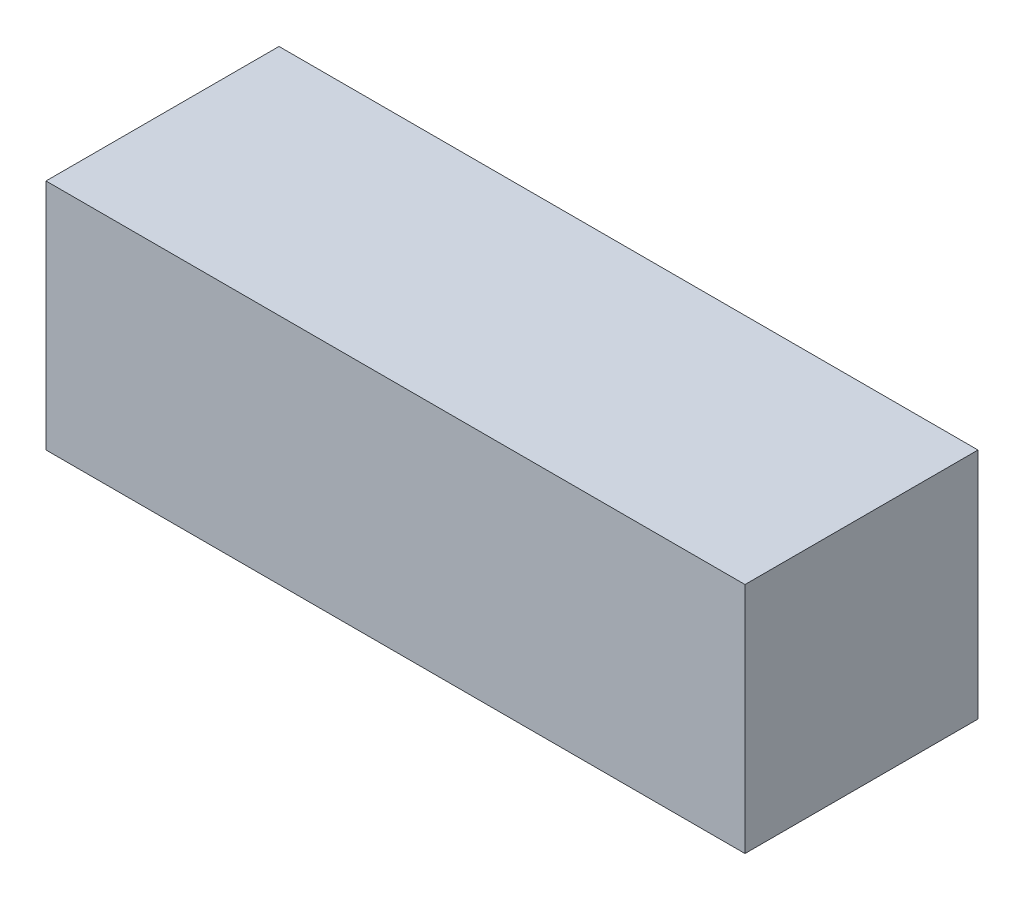
ISO-10303-21;
HEADER;
FILE_DESCRIPTION(('STEP AP214'),'2;1');
FILE_NAME('part.step','',(''),(''),'','','');
FILE_SCHEMA(('AUTOMOTIVE_DESIGN { 1 0 10303 214 1 1 1 1 }'));
ENDSEC;
DATA;
#1=APPLICATION_CONTEXT('core data for automotive mechanical design processes');
#2=APPLICATION_PROTOCOL_DEFINITION('international standard','automotive_design',2000,#1);
#3=PRODUCT_CONTEXT('',#1,'mechanical');
#4=PRODUCT('Part','Part','',(#3));
#5=PRODUCT_RELATED_PRODUCT_CATEGORY('part','',(#4));
#6=PRODUCT_DEFINITION_FORMATION('','',#4);
#7=PRODUCT_DEFINITION_CONTEXT('part definition',#1,'design');
#8=PRODUCT_DEFINITION('design','',#6,#7);
#9=PRODUCT_DEFINITION_SHAPE('','',#8);
#10=(LENGTH_UNIT() NAMED_UNIT(*) SI_UNIT(.MILLI.,.METRE.));
#11=(NAMED_UNIT(*) PLANE_ANGLE_UNIT() SI_UNIT($,.RADIAN.));
#12=(NAMED_UNIT(*) SI_UNIT($,.STERADIAN.) SOLID_ANGLE_UNIT());
#13=UNCERTAINTY_MEASURE_WITH_UNIT(LENGTH_MEASURE(1.E-05),#10,'distance_accuracy_value','');
#14=(GEOMETRIC_REPRESENTATION_CONTEXT(3) GLOBAL_UNCERTAINTY_ASSIGNED_CONTEXT((#13)) GLOBAL_UNIT_ASSIGNED_CONTEXT((#10,
#11,#12)) REPRESENTATION_CONTEXT('',''));
#15=CARTESIAN_POINT('',(0.,0.,0.));
#16=DIRECTION('',(0.,0.,1.));
#17=DIRECTION('',(1.,0.,0.));
#18=AXIS2_PLACEMENT_3D('',#15,#16,#17);
#19=CARTESIAN_POINT('',(3.,2.,-1.));
#20=DIRECTION('',(-1.,0.,0.));
#21=DIRECTION('',(0.,0.,1.));
#22=AXIS2_PLACEMENT_3D('',#19,#20,#21);
#23=PLANE('',#22);
#24=DIRECTION('',(0.,0.,-1.));
#25=VECTOR('',#24,1.);
#26=CARTESIAN_POINT('',(3.,0.,-1.));
#27=LINE('',#26,#25);
#28=CARTESIAN_POINT('',(3.,0.,1.));
#29=VERTEX_POINT('',#28);
#30=CARTESIAN_POINT('',(3.,0.,-1.));
#31=VERTEX_POINT('',#30);
#32=EDGE_CURVE('E99',#29,#31,#27,.T.);
#33=ORIENTED_EDGE('',*,*,#32,.T.);
#34=DIRECTION('',(0.,-1.,0.));
#35=VECTOR('',#34,1.);
#36=CARTESIAN_POINT('',(3.,2.,-1.));
#37=LINE('',#36,#35);
#38=CARTESIAN_POINT('',(3.,2.,-1.));
#39=VERTEX_POINT('',#38);
#40=EDGE_CURVE('E11',#39,#31,#37,.T.);
#41=ORIENTED_EDGE('',*,*,#40,.F.);
#42=DIRECTION('',(0.,0.,-1.));
#43=VECTOR('',#42,1.);
#44=CARTESIAN_POINT('',(3.,2.,-1.));
#45=LINE('',#44,#43);
#46=CARTESIAN_POINT('',(3.,2.,1.));
#47=VERTEX_POINT('',#46);
#48=EDGE_CURVE('E87',#47,#39,#45,.T.);
#49=ORIENTED_EDGE('',*,*,#48,.F.);
#50=DIRECTION('',(0.,-1.,0.));
#51=VECTOR('',#50,1.);
#52=CARTESIAN_POINT('',(3.,2.,1.));
#53=LINE('',#52,#51);
#54=EDGE_CURVE('E95',#47,#29,#53,.T.);
#55=ORIENTED_EDGE('',*,*,#54,.T.);
#56=EDGE_LOOP('',(#33,#41,#49,#55));
#57=FACE_BOUND('',#56,.T.);
#58=ADVANCED_FACE('F36',(#57),#23,.F.);
#59=CARTESIAN_POINT('',(-3.,2.,-1.));
#60=DIRECTION('',(0.,0.,1.));
#61=DIRECTION('',(1.,0.,0.));
#62=AXIS2_PLACEMENT_3D('',#59,#60,#61);
#63=PLANE('',#62);
#64=DIRECTION('',(-1.,0.,0.));
#65=VECTOR('',#64,1.);
#66=CARTESIAN_POINT('',(-3.,0.,-1.));
#67=LINE('',#66,#65);
#68=CARTESIAN_POINT('',(-3.,0.,-1.));
#69=VERTEX_POINT('',#68);
#70=EDGE_CURVE('E91',#31,#69,#67,.T.);
#71=ORIENTED_EDGE('',*,*,#70,.T.);
#72=DIRECTION('',(0.,-1.,0.));
#73=VECTOR('',#72,1.);
#74=CARTESIAN_POINT('',(-3.,2.,-1.));
#75=LINE('',#74,#73);
#76=CARTESIAN_POINT('',(-3.,2.,-1.));
#77=VERTEX_POINT('',#76);
#78=EDGE_CURVE('E44',#77,#69,#75,.T.);
#79=ORIENTED_EDGE('',*,*,#78,.F.);
#80=DIRECTION('',(-1.,0.,0.));
#81=VECTOR('',#80,1.);
#82=CARTESIAN_POINT('',(-3.,2.,-1.));
#83=LINE('',#82,#81);
#84=EDGE_CURVE('E82',#39,#77,#83,.T.);
#85=ORIENTED_EDGE('',*,*,#84,.F.);
#86=ORIENTED_EDGE('',*,*,#40,.T.);
#87=EDGE_LOOP('',(#71,#79,#85,#86));
#88=FACE_BOUND('',#87,.T.);
#89=ADVANCED_FACE('F90',(#88),#63,.F.);
#90=CARTESIAN_POINT('',(-3.,2.,-1.));
#91=DIRECTION('',(1.,0.,0.));
#92=DIRECTION('',(0.,0.,-1.));
#93=AXIS2_PLACEMENT_3D('',#90,#91,#92);
#94=PLANE('',#93);
#95=DIRECTION('',(0.,0.,1.));
#96=VECTOR('',#95,1.);
#97=CARTESIAN_POINT('',(-3.,0.,-1.));
#98=LINE('',#97,#96);
#99=CARTESIAN_POINT('',(-3.,0.,1.));
#100=VERTEX_POINT('',#99);
#101=EDGE_CURVE('E69',#69,#100,#98,.T.);
#102=ORIENTED_EDGE('',*,*,#101,.T.);
#103=DIRECTION('',(0.,-1.,0.));
#104=VECTOR('',#103,1.);
#105=CARTESIAN_POINT('',(-3.,2.,1.));
#106=LINE('',#105,#104);
#107=CARTESIAN_POINT('',(-3.,2.,1.));
#108=VERTEX_POINT('',#107);
#109=EDGE_CURVE('E92',#108,#100,#106,.T.);
#110=ORIENTED_EDGE('',*,*,#109,.F.);
#111=DIRECTION('',(0.,0.,1.));
#112=VECTOR('',#111,1.);
#113=CARTESIAN_POINT('',(-3.,2.,-1.));
#114=LINE('',#113,#112);
#115=EDGE_CURVE('E85',#77,#108,#114,.T.);
#116=ORIENTED_EDGE('',*,*,#115,.F.);
#117=ORIENTED_EDGE('',*,*,#78,.T.);
#118=EDGE_LOOP('',(#102,#110,#116,#117));
#119=FACE_BOUND('',#118,.T.);
#120=ADVANCED_FACE('F93',(#119),#94,.F.);
#121=CARTESIAN_POINT('',(-3.,2.,1.));
#122=DIRECTION('',(0.,0.,-1.));
#123=DIRECTION('',(-1.,0.,0.));
#124=AXIS2_PLACEMENT_3D('',#121,#122,#123);
#125=PLANE('',#124);
#126=DIRECTION('',(1.,0.,0.));
#127=VECTOR('',#126,1.);
#128=CARTESIAN_POINT('',(-3.,0.,1.));
#129=LINE('',#128,#127);
#130=EDGE_CURVE('E75',#100,#29,#129,.T.);
#131=ORIENTED_EDGE('',*,*,#130,.T.);
#132=ORIENTED_EDGE('',*,*,#54,.F.);
#133=DIRECTION('',(1.,0.,0.));
#134=VECTOR('',#133,1.);
#135=CARTESIAN_POINT('',(-3.,2.,1.));
#136=LINE('',#135,#134);
#137=EDGE_CURVE('E52',#108,#47,#136,.T.);
#138=ORIENTED_EDGE('',*,*,#137,.F.);
#139=ORIENTED_EDGE('',*,*,#109,.T.);
#140=EDGE_LOOP('',(#131,#132,#138,#139));
#141=FACE_BOUND('',#140,.T.);
#142=ADVANCED_FACE('F106',(#141),#125,.F.);
#143=CARTESIAN_POINT('',(0.,2.,0.));
#144=DIRECTION('',(0.,1.,0.));
#145=DIRECTION('',(0.,0.,1.));
#146=AXIS2_PLACEMENT_3D('',#143,#144,#145);
#147=PLANE('',#146);
#148=ORIENTED_EDGE('',*,*,#48,.T.);
#149=ORIENTED_EDGE('',*,*,#84,.T.);
#150=ORIENTED_EDGE('',*,*,#115,.T.);
#151=ORIENTED_EDGE('',*,*,#137,.T.);
#152=EDGE_LOOP('',(#148,#149,#150,#151));
#153=FACE_BOUND('',#152,.T.);
#154=ADVANCED_FACE('F83',(#153),#147,.T.);
#155=CARTESIAN_POINT('',(0.,0.,0.));
#156=DIRECTION('',(0.,1.,0.));
#157=DIRECTION('',(0.,0.,1.));
#158=AXIS2_PLACEMENT_3D('',#155,#156,#157);
#159=PLANE('',#158);
#160=ORIENTED_EDGE('',*,*,#32,.F.);
#161=ORIENTED_EDGE('',*,*,#130,.F.);
#162=ORIENTED_EDGE('',*,*,#101,.F.);
#163=ORIENTED_EDGE('',*,*,#70,.F.);
#164=EDGE_LOOP('',(#160,#161,#162,#163));
#165=FACE_BOUND('',#164,.T.);
#166=ADVANCED_FACE('F109',(#165),#159,.F.);
#167=CLOSED_SHELL('',(#58,#89,#120,#142,#154,#166));
#168=MANIFOLD_SOLID_BREP('B2',#167);
#169=ADVANCED_BREP_SHAPE_REPRESENTATION('',(#18,#168),#14);
#170=SHAPE_DEFINITION_REPRESENTATION(#9,#169);
ENDSEC;
END-ISO-10303-21;
